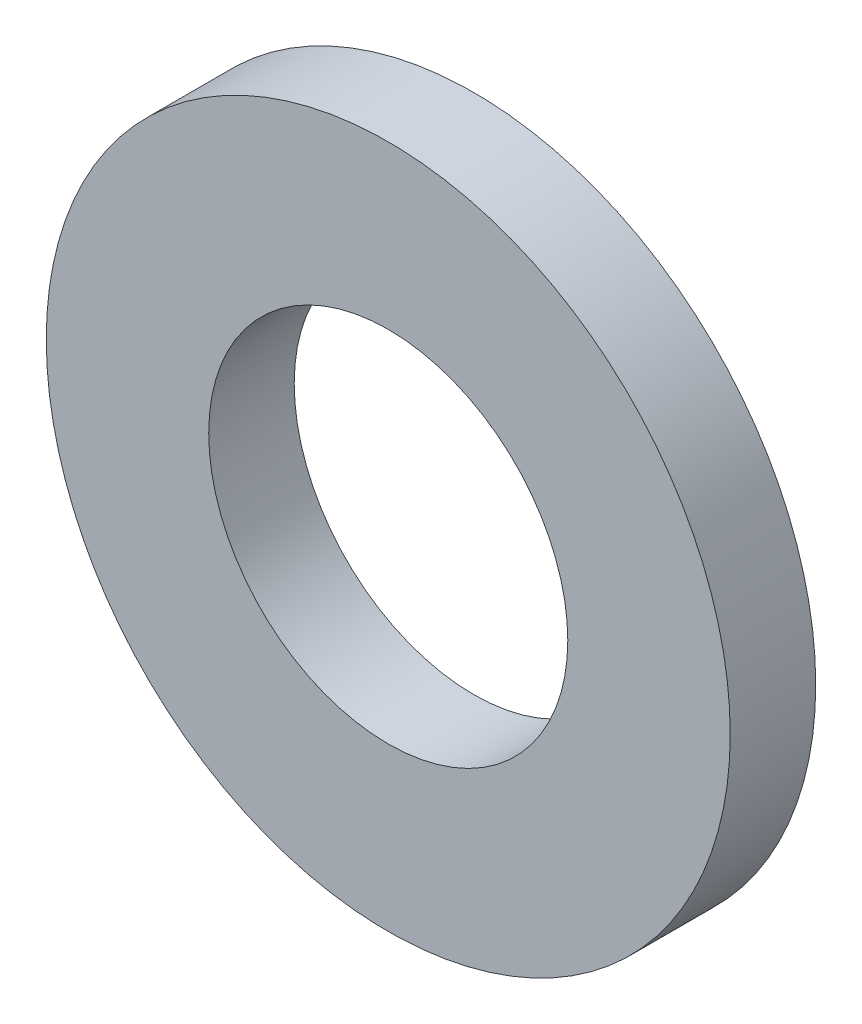
ISO-10303-21;
HEADER;
FILE_DESCRIPTION(('STEP AP214'),'2;1');
FILE_NAME('part.step','',(''),(''),'','','');
FILE_SCHEMA(('AUTOMOTIVE_DESIGN { 1 0 10303 214 1 1 1 1 }'));
ENDSEC;
DATA;
#1=APPLICATION_CONTEXT('core data for automotive mechanical design processes');
#2=APPLICATION_PROTOCOL_DEFINITION('international standard','automotive_design',2000,#1);
#3=PRODUCT_CONTEXT('',#1,'mechanical');
#4=PRODUCT('Part','Part','',(#3));
#5=PRODUCT_RELATED_PRODUCT_CATEGORY('part','',(#4));
#6=PRODUCT_DEFINITION_FORMATION('','',#4);
#7=PRODUCT_DEFINITION_CONTEXT('part definition',#1,'design');
#8=PRODUCT_DEFINITION('design','',#6,#7);
#9=PRODUCT_DEFINITION_SHAPE('','',#8);
#10=(LENGTH_UNIT() NAMED_UNIT(*) SI_UNIT(.MILLI.,.METRE.));
#11=(NAMED_UNIT(*) PLANE_ANGLE_UNIT() SI_UNIT($,.RADIAN.));
#12=(NAMED_UNIT(*) SI_UNIT($,.STERADIAN.) SOLID_ANGLE_UNIT());
#13=UNCERTAINTY_MEASURE_WITH_UNIT(LENGTH_MEASURE(1.E-05),#10,'distance_accuracy_value','');
#14=(GEOMETRIC_REPRESENTATION_CONTEXT(3) GLOBAL_UNCERTAINTY_ASSIGNED_CONTEXT((#13)) GLOBAL_UNIT_ASSIGNED_CONTEXT((#10,
#11,#12)) REPRESENTATION_CONTEXT('',''));
#15=CARTESIAN_POINT('',(0.,0.,0.));
#16=DIRECTION('',(0.,0.,1.));
#17=DIRECTION('',(1.,0.,0.));
#18=AXIS2_PLACEMENT_3D('',#15,#16,#17);
#19=CARTESIAN_POINT('',(0.,0.,0.25));
#20=DIRECTION('',(0.,0.,1.));
#21=DIRECTION('',(1.,0.,0.));
#22=AXIS2_PLACEMENT_3D('',#19,#20,#21);
#23=PLANE('',#22);
#24=CARTESIAN_POINT('',(0.,0.,0.25));
#25=DIRECTION('',(0.,0.,1.));
#26=DIRECTION('',(1.,0.,0.));
#27=AXIS2_PLACEMENT_3D('',#24,#25,#26);
#28=CIRCLE('',#27,2.);
#29=CARTESIAN_POINT('',(2.,0.,0.25));
#30=VERTEX_POINT('',#29);
#31=EDGE_CURVE('E10',#30,#30,#28,.T.);
#32=ORIENTED_EDGE('',*,*,#31,.T.);
#33=EDGE_LOOP('',(#32));
#34=FACE_BOUND('',#33,.T.);
#35=CARTESIAN_POINT('',(0.,0.,0.25));
#36=DIRECTION('',(0.,0.,1.));
#37=DIRECTION('',(1.,0.,0.));
#38=AXIS2_PLACEMENT_3D('',#35,#36,#37);
#39=CIRCLE('',#38,1.05);
#40=CARTESIAN_POINT('',(1.05,0.,0.25));
#41=VERTEX_POINT('',#40);
#42=EDGE_CURVE('E52',#41,#41,#39,.T.);
#43=ORIENTED_EDGE('',*,*,#42,.F.);
#44=EDGE_LOOP('',(#43));
#45=FACE_BOUND('',#44,.T.);
#46=ADVANCED_FACE('F39',(#34,#45),#23,.T.);
#47=CARTESIAN_POINT('',(0.,0.,-0.25));
#48=DIRECTION('',(0.,0.,1.));
#49=DIRECTION('',(1.,0.,0.));
#50=AXIS2_PLACEMENT_3D('',#47,#48,#49);
#51=PLANE('',#50);
#52=CARTESIAN_POINT('',(0.,0.,-0.25));
#53=DIRECTION('',(0.,0.,1.));
#54=DIRECTION('',(1.,0.,0.));
#55=AXIS2_PLACEMENT_3D('',#52,#53,#54);
#56=CIRCLE('',#55,2.);
#57=CARTESIAN_POINT('',(2.,0.,-0.25));
#58=VERTEX_POINT('',#57);
#59=EDGE_CURVE('E43',#58,#58,#56,.T.);
#60=ORIENTED_EDGE('',*,*,#59,.F.);
#61=EDGE_LOOP('',(#60));
#62=FACE_BOUND('',#61,.T.);
#63=CARTESIAN_POINT('',(0.,0.,-0.25));
#64=DIRECTION('',(0.,0.,1.));
#65=DIRECTION('',(1.,0.,0.));
#66=AXIS2_PLACEMENT_3D('',#63,#64,#65);
#67=CIRCLE('',#66,1.05);
#68=CARTESIAN_POINT('',(1.05,0.,-0.25));
#69=VERTEX_POINT('',#68);
#70=EDGE_CURVE('E54',#69,#69,#67,.T.);
#71=ORIENTED_EDGE('',*,*,#70,.T.);
#72=EDGE_LOOP('',(#71));
#73=FACE_BOUND('',#72,.T.);
#74=ADVANCED_FACE('F66',(#62,#73),#51,.F.);
#75=CARTESIAN_POINT('',(0.,0.,0.25));
#76=DIRECTION('',(0.,0.,-1.));
#77=DIRECTION('',(-1.,0.,0.));
#78=AXIS2_PLACEMENT_3D('',#75,#76,#77);
#79=CYLINDRICAL_SURFACE('',#78,2.);
#80=ORIENTED_EDGE('',*,*,#31,.F.);
#81=EDGE_LOOP('',(#80));
#82=FACE_BOUND('',#81,.T.);
#83=ORIENTED_EDGE('',*,*,#59,.T.);
#84=EDGE_LOOP('',(#83));
#85=FACE_BOUND('',#84,.T.);
#86=ADVANCED_FACE('F41',(#82,#85),#79,.T.);
#87=CARTESIAN_POINT('',(0.,0.,0.25));
#88=DIRECTION('',(0.,0.,-1.));
#89=DIRECTION('',(-1.,0.,0.));
#90=AXIS2_PLACEMENT_3D('',#87,#88,#89);
#91=CYLINDRICAL_SURFACE('',#90,1.05);
#92=ORIENTED_EDGE('',*,*,#42,.T.);
#93=EDGE_LOOP('',(#92));
#94=FACE_BOUND('',#93,.T.);
#95=ORIENTED_EDGE('',*,*,#70,.F.);
#96=EDGE_LOOP('',(#95));
#97=FACE_BOUND('',#96,.T.);
#98=ADVANCED_FACE('F62',(#94,#97),#91,.F.);
#99=CLOSED_SHELL('',(#46,#74,#86,#98));
#100=MANIFOLD_SOLID_BREP('B2',#99);
#101=ADVANCED_BREP_SHAPE_REPRESENTATION('',(#18,#100),#14);
#102=SHAPE_DEFINITION_REPRESENTATION(#9,#101);
ENDSEC;
END-ISO-10303-21;
